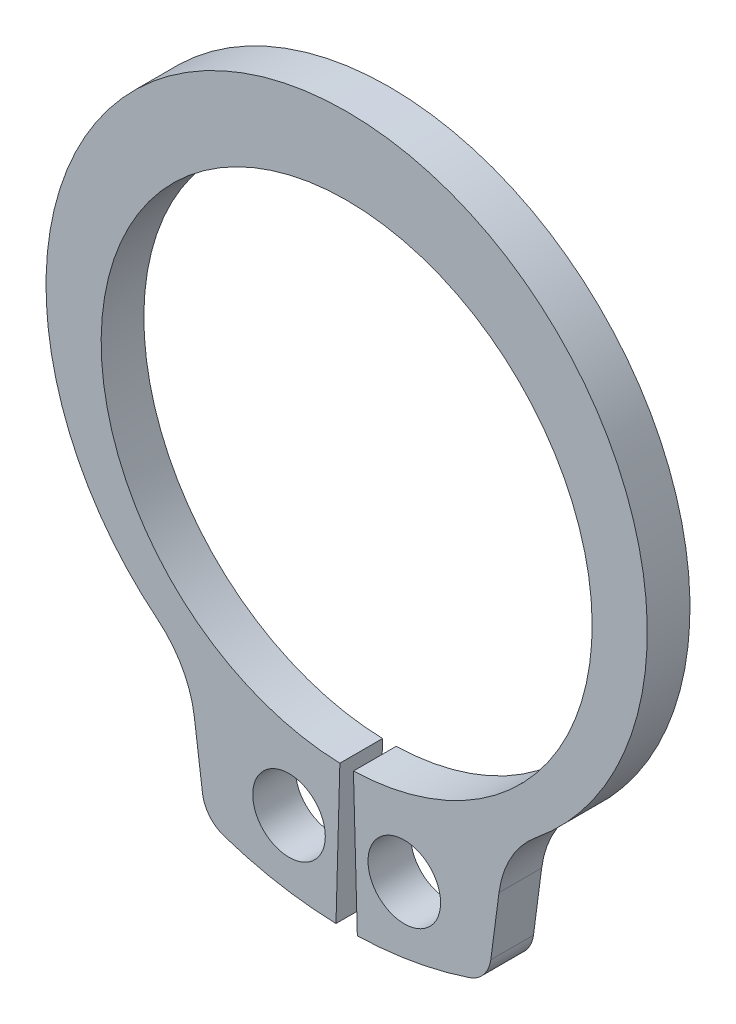
ISO-10303-21;
HEADER;
FILE_DESCRIPTION(('STEP AP214'),'2;1');
FILE_NAME('part.step','',(''),(''),'','','');
FILE_SCHEMA(('AUTOMOTIVE_DESIGN { 1 0 10303 214 1 1 1 1 }'));
ENDSEC;
DATA;
#1=APPLICATION_CONTEXT('core data for automotive mechanical design processes');
#2=APPLICATION_PROTOCOL_DEFINITION('international standard','automotive_design',2000,#1);
#3=PRODUCT_CONTEXT('',#1,'mechanical');
#4=PRODUCT('Part','Part','',(#3));
#5=PRODUCT_RELATED_PRODUCT_CATEGORY('part','',(#4));
#6=PRODUCT_DEFINITION_FORMATION('','',#4);
#7=PRODUCT_DEFINITION_CONTEXT('part definition',#1,'design');
#8=PRODUCT_DEFINITION('design','',#6,#7);
#9=PRODUCT_DEFINITION_SHAPE('','',#8);
#10=(LENGTH_UNIT() NAMED_UNIT(*) SI_UNIT(.MILLI.,.METRE.));
#11=(NAMED_UNIT(*) PLANE_ANGLE_UNIT() SI_UNIT($,.RADIAN.));
#12=(NAMED_UNIT(*) SI_UNIT($,.STERADIAN.) SOLID_ANGLE_UNIT());
#13=UNCERTAINTY_MEASURE_WITH_UNIT(LENGTH_MEASURE(1.E-05),#10,'distance_accuracy_value','');
#14=(GEOMETRIC_REPRESENTATION_CONTEXT(3) GLOBAL_UNCERTAINTY_ASSIGNED_CONTEXT((#13)) GLOBAL_UNIT_ASSIGNED_CONTEXT((#10,
#11,#12)) REPRESENTATION_CONTEXT('',''));
#15=CARTESIAN_POINT('',(0.,0.,0.));
#16=DIRECTION('',(0.,0.,1.));
#17=DIRECTION('',(1.,0.,0.));
#18=AXIS2_PLACEMENT_3D('',#15,#16,#17);
#19=CARTESIAN_POINT('',(0.,0.,-1.));
#20=DIRECTION('',(0.,0.,1.));
#21=DIRECTION('',(1.,0.,0.));
#22=AXIS2_PLACEMENT_3D('',#19,#20,#21);
#23=CYLINDRICAL_SURFACE('',#22,5.75);
#24=CARTESIAN_POINT('',(0.,0.,0.));
#25=DIRECTION('',(0.,0.,-1.));
#26=DIRECTION('',(1.,0.,0.));
#27=AXIS2_PLACEMENT_3D('',#24,#25,#26);
#28=CIRCLE('',#27,5.75);
#29=CARTESIAN_POINT('',(-0.158839779005525,-5.74780566169434,0.));
#30=VERTEX_POINT('',#29);
#31=CARTESIAN_POINT('',(0.158839779005525,-5.74780566169434,0.));
#32=VERTEX_POINT('',#31);
#33=EDGE_CURVE('E153',#30,#32,#28,.T.);
#34=ORIENTED_EDGE('',*,*,#33,.F.);
#35=DIRECTION('',(0.,0.,1.));
#36=VECTOR('',#35,1.);
#37=CARTESIAN_POINT('',(-0.158839779005525,-5.74780566169434,-1.));
#38=LINE('',#37,#36);
#39=CARTESIAN_POINT('',(-0.158839779005525,-5.74780566169434,-1.));
#40=VERTEX_POINT('',#39);
#41=EDGE_CURVE('E11',#40,#30,#38,.T.);
#42=ORIENTED_EDGE('',*,*,#41,.F.);
#43=CARTESIAN_POINT('',(0.,0.,-1.));
#44=DIRECTION('',(0.,0.,-1.));
#45=DIRECTION('',(1.,0.,0.));
#46=AXIS2_PLACEMENT_3D('',#43,#44,#45);
#47=CIRCLE('',#46,5.75);
#48=CARTESIAN_POINT('',(0.158839779005525,-5.74780566169434,-1.));
#49=VERTEX_POINT('',#48);
#50=EDGE_CURVE('E186',#40,#49,#47,.T.);
#51=ORIENTED_EDGE('',*,*,#50,.T.);
#52=DIRECTION('',(0.,0.,1.));
#53=VECTOR('',#52,1.);
#54=CARTESIAN_POINT('',(0.158839779005525,-5.74780566169434,-1.));
#55=LINE('',#54,#53);
#56=EDGE_CURVE('E35',#49,#32,#55,.T.);
#57=ORIENTED_EDGE('',*,*,#56,.T.);
#58=EDGE_LOOP('',(#34,#42,#51,#57));
#59=FACE_BOUND('',#58,.T.);
#60=ADVANCED_FACE('F32',(#59),#23,.F.);
#61=CARTESIAN_POINT('',(-0.158839779005525,-5.74780566169434,-1.));
#62=DIRECTION('',(0.999618375946841,-0.0276243093922652,0.));
#63=DIRECTION('',(0.0276243093922652,0.999618375946841,0.));
#64=AXIS2_PLACEMENT_3D('',#61,#62,#63);
#65=PLANE('',#64);
#66=DIRECTION('',(0.0276243093922652,0.999618375946841,0.));
#67=VECTOR('',#66,1.);
#68=CARTESIAN_POINT('',(-0.158839779005525,-5.74780566169434,0.));
#69=LINE('',#68,#67);
#70=CARTESIAN_POINT('',(-0.25,-9.04654630231891,0.));
#71=VERTEX_POINT('',#70);
#72=EDGE_CURVE('E184',#71,#30,#69,.T.);
#73=ORIENTED_EDGE('',*,*,#72,.F.);
#74=DIRECTION('',(0.,0.,1.));
#75=VECTOR('',#74,1.);
#76=CARTESIAN_POINT('',(-0.25,-9.04654630231891,-1.));
#77=LINE('',#76,#75);
#78=CARTESIAN_POINT('',(-0.25,-9.04654630231891,-1.));
#79=VERTEX_POINT('',#78);
#80=EDGE_CURVE('E41',#79,#71,#77,.T.);
#81=ORIENTED_EDGE('',*,*,#80,.F.);
#82=DIRECTION('',(0.0276243093922652,0.999618375946841,0.));
#83=VECTOR('',#82,1.);
#84=CARTESIAN_POINT('',(-0.158839779005525,-5.74780566169434,-1.));
#85=LINE('',#84,#83);
#86=EDGE_CURVE('E143',#79,#40,#85,.T.);
#87=ORIENTED_EDGE('',*,*,#86,.T.);
#88=ORIENTED_EDGE('',*,*,#41,.T.);
#89=EDGE_LOOP('',(#73,#81,#87,#88));
#90=FACE_BOUND('',#89,.T.);
#91=ADVANCED_FACE('F206',(#90),#65,.T.);
#92=CARTESIAN_POINT('',(0.,0.,-1.));
#93=DIRECTION('',(0.,0.,1.));
#94=DIRECTION('',(1.,0.,0.));
#95=AXIS2_PLACEMENT_3D('',#92,#93,#94);
#96=CYLINDRICAL_SURFACE('',#95,9.05);
#97=CARTESIAN_POINT('',(0.,0.,0.));
#98=DIRECTION('',(0.,0.,1.));
#99=DIRECTION('',(1.,0.,0.));
#100=AXIS2_PLACEMENT_3D('',#97,#98,#99);
#101=CIRCLE('',#100,9.05);
#102=CARTESIAN_POINT('',(-2.87007776682859,-8.5828406493629,0.));
#103=VERTEX_POINT('',#102);
#104=EDGE_CURVE('E130',#103,#71,#101,.T.);
#105=ORIENTED_EDGE('',*,*,#104,.F.);
#106=DIRECTION('',(0.,0.,1.));
#107=VECTOR('',#106,1.);
#108=CARTESIAN_POINT('',(-2.87007776682859,-8.5828406493629,-1.));
#109=LINE('',#108,#107);
#110=CARTESIAN_POINT('',(-2.87007776682859,-8.5828406493629,-1.));
#111=VERTEX_POINT('',#110);
#112=EDGE_CURVE('E125',#111,#103,#109,.T.);
#113=ORIENTED_EDGE('',*,*,#112,.F.);
#114=CARTESIAN_POINT('',(0.,0.,-1.));
#115=DIRECTION('',(0.,0.,1.));
#116=DIRECTION('',(1.,0.,0.));
#117=AXIS2_PLACEMENT_3D('',#114,#115,#116);
#118=CIRCLE('',#117,9.05);
#119=EDGE_CURVE('E128',#111,#79,#118,.T.);
#120=ORIENTED_EDGE('',*,*,#119,.T.);
#121=ORIENTED_EDGE('',*,*,#80,.T.);
#122=EDGE_LOOP('',(#105,#113,#120,#121));
#123=FACE_BOUND('',#122,.T.);
#124=ADVANCED_FACE('F127',(#123),#96,.T.);
#125=CARTESIAN_POINT('',(-2.63222601819639,-7.87155551267537,-1.));
#126=DIRECTION('',(0.,0.,1.));
#127=DIRECTION('',(1.,0.,0.));
#128=AXIS2_PLACEMENT_3D('',#125,#126,#127);
#129=CYLINDRICAL_SURFACE('',#128,0.749999999999999);
#130=CARTESIAN_POINT('',(-2.63222601819639,-7.87155551267537,0.));
#131=DIRECTION('',(0.,0.,1.));
#132=DIRECTION('',(1.,0.,0.));
#133=AXIS2_PLACEMENT_3D('',#130,#131,#132);
#134=CIRCLE('',#133,0.749999999999999);
#135=CARTESIAN_POINT('',(-3.37580966422674,-7.96945015684041,0.));
#136=VERTEX_POINT('',#135);
#137=EDGE_CURVE('E181',#136,#103,#134,.T.);
#138=ORIENTED_EDGE('',*,*,#137,.F.);
#139=DIRECTION('',(0.,0.,1.));
#140=VECTOR('',#139,1.);
#141=CARTESIAN_POINT('',(-3.37580966422674,-7.96945015684041,-1.));
#142=LINE('',#141,#140);
#143=CARTESIAN_POINT('',(-3.37580966422674,-7.96945015684041,-1.));
#144=VERTEX_POINT('',#143);
#145=EDGE_CURVE('E135',#144,#136,#142,.T.);
#146=ORIENTED_EDGE('',*,*,#145,.F.);
#147=CARTESIAN_POINT('',(-2.63222601819639,-7.87155551267537,-1.));
#148=DIRECTION('',(0.,0.,1.));
#149=DIRECTION('',(1.,0.,0.));
#150=AXIS2_PLACEMENT_3D('',#147,#148,#149);
#151=CIRCLE('',#150,0.749999999999999);
#152=EDGE_CURVE('E141',#144,#111,#151,.T.);
#153=ORIENTED_EDGE('',*,*,#152,.T.);
#154=ORIENTED_EDGE('',*,*,#112,.T.);
#155=EDGE_LOOP('',(#138,#146,#153,#154));
#156=FACE_BOUND('',#155,.T.);
#157=ADVANCED_FACE('F145',(#156),#129,.T.);
#158=CARTESIAN_POINT('',(-3.56793709135462,-6.51009746206657,-1.));
#159=DIRECTION('',(-0.99144486137381,-0.130526192220053,0.));
#160=DIRECTION('',(0.130526192220053,-0.99144486137381,0.));
#161=AXIS2_PLACEMENT_3D('',#158,#159,#160);
#162=PLANE('',#161);
#163=DIRECTION('',(0.130526192220053,-0.99144486137381,0.));
#164=VECTOR('',#163,1.);
#165=CARTESIAN_POINT('',(-3.56793709135462,-6.51009746206657,0.));
#166=LINE('',#165,#164);
#167=CARTESIAN_POINT('',(-3.56793709135462,-6.51009746206657,0.));
#168=VERTEX_POINT('',#167);
#169=EDGE_CURVE('E178',#168,#136,#166,.T.);
#170=ORIENTED_EDGE('',*,*,#169,.F.);
#171=DIRECTION('',(0.,0.,1.));
#172=VECTOR('',#171,1.);
#173=CARTESIAN_POINT('',(-3.56793709135462,-6.51009746206657,-1.));
#174=LINE('',#173,#172);
#175=CARTESIAN_POINT('',(-3.56793709135462,-6.51009746206657,-1.));
#176=VERTEX_POINT('',#175);
#177=EDGE_CURVE('E190',#176,#168,#174,.T.);
#178=ORIENTED_EDGE('',*,*,#177,.F.);
#179=DIRECTION('',(0.130526192220053,-0.99144486137381,0.));
#180=VECTOR('',#179,1.);
#181=CARTESIAN_POINT('',(-3.56793709135462,-6.51009746206657,-1.));
#182=LINE('',#181,#180);
#183=EDGE_CURVE('E146',#176,#144,#182,.T.);
#184=ORIENTED_EDGE('',*,*,#183,.T.);
#185=ORIENTED_EDGE('',*,*,#145,.T.);
#186=EDGE_LOOP('',(#170,#178,#184,#185));
#187=FACE_BOUND('',#186,.T.);
#188=ADVANCED_FACE('F219',(#187),#162,.T.);
#189=CARTESIAN_POINT('',(-5.94540544054401,-6.82309710817233,-1.));
#190=DIRECTION('',(0.,0.,1.));
#191=DIRECTION('',(1.,0.,0.));
#192=AXIS2_PLACEMENT_3D('',#189,#190,#191);
#193=CYLINDRICAL_SURFACE('',#192,2.39798342985511);
#194=CARTESIAN_POINT('',(-5.94540544054401,-6.82309710817233,0.));
#195=DIRECTION('',(0.,0.,-1.));
#196=DIRECTION('',(1.,0.,0.));
#197=AXIS2_PLACEMENT_3D('',#194,#195,#196);
#198=CIRCLE('',#197,2.39798342985511);
#199=CARTESIAN_POINT('',(-4.43503151096838,-4.96054640477713,0.));
#200=VERTEX_POINT('',#199);
#201=EDGE_CURVE('E175',#200,#168,#198,.T.);
#202=ORIENTED_EDGE('',*,*,#201,.F.);
#203=DIRECTION('',(0.,0.,1.));
#204=VECTOR('',#203,1.);
#205=CARTESIAN_POINT('',(-4.43503151096838,-4.96054640477713,-1.));
#206=LINE('',#205,#204);
#207=CARTESIAN_POINT('',(-4.43503151096838,-4.96054640477713,-1.));
#208=VERTEX_POINT('',#207);
#209=EDGE_CURVE('E192',#208,#200,#206,.T.);
#210=ORIENTED_EDGE('',*,*,#209,.F.);
#211=CARTESIAN_POINT('',(-5.94540544054401,-6.82309710817233,-1.));
#212=DIRECTION('',(0.,0.,-1.));
#213=DIRECTION('',(1.,0.,0.));
#214=AXIS2_PLACEMENT_3D('',#211,#212,#213);
#215=CIRCLE('',#214,2.39798342985511);
#216=EDGE_CURVE('E148',#208,#176,#215,.T.);
#217=ORIENTED_EDGE('',*,*,#216,.T.);
#218=ORIENTED_EDGE('',*,*,#177,.T.);
#219=EDGE_LOOP('',(#202,#210,#217,#218));
#220=FACE_BOUND('',#219,.T.);
#221=ADVANCED_FACE('F222',(#220),#193,.F.);
#222=CARTESIAN_POINT('',(0.,0.508609874062364,-1.));
#223=DIRECTION('',(0.,0.,1.));
#224=DIRECTION('',(1.,0.,0.));
#225=AXIS2_PLACEMENT_3D('',#222,#223,#224);
#226=CYLINDRICAL_SURFACE('',#225,7.04139012593763);
#227=CARTESIAN_POINT('',(0.,0.508609874062364,0.));
#228=DIRECTION('',(0.,0.,1.));
#229=DIRECTION('',(1.,0.,0.));
#230=AXIS2_PLACEMENT_3D('',#227,#228,#229);
#231=CIRCLE('',#230,7.04139012593763);
#232=CARTESIAN_POINT('',(4.43503151096838,-4.96054640477713,0.));
#233=VERTEX_POINT('',#232);
#234=EDGE_CURVE('E172',#233,#200,#231,.T.);
#235=ORIENTED_EDGE('',*,*,#234,.F.);
#236=DIRECTION('',(0.,0.,1.));
#237=VECTOR('',#236,1.);
#238=CARTESIAN_POINT('',(4.43503151096838,-4.96054640477713,-1.));
#239=LINE('',#238,#237);
#240=CARTESIAN_POINT('',(4.43503151096838,-4.96054640477713,-1.));
#241=VERTEX_POINT('',#240);
#242=EDGE_CURVE('E194',#241,#233,#239,.T.);
#243=ORIENTED_EDGE('',*,*,#242,.F.);
#244=CARTESIAN_POINT('',(0.,0.508609874062364,-1.));
#245=DIRECTION('',(0.,0.,1.));
#246=DIRECTION('',(1.,0.,0.));
#247=AXIS2_PLACEMENT_3D('',#244,#245,#246);
#248=CIRCLE('',#247,7.04139012593763);
#249=EDGE_CURVE('E296',#241,#208,#248,.T.);
#250=ORIENTED_EDGE('',*,*,#249,.T.);
#251=ORIENTED_EDGE('',*,*,#209,.T.);
#252=EDGE_LOOP('',(#235,#243,#250,#251));
#253=FACE_BOUND('',#252,.T.);
#254=ADVANCED_FACE('F226',(#253),#226,.T.);
#255=CARTESIAN_POINT('',(5.94540544054401,-6.82309710817233,-1.));
#256=DIRECTION('',(0.,0.,1.));
#257=DIRECTION('',(1.,0.,0.));
#258=AXIS2_PLACEMENT_3D('',#255,#256,#257);
#259=CYLINDRICAL_SURFACE('',#258,2.39798342985511);
#260=CARTESIAN_POINT('',(5.94540544054401,-6.82309710817233,0.));
#261=DIRECTION('',(0.,0.,-1.));
#262=DIRECTION('',(1.,0.,0.));
#263=AXIS2_PLACEMENT_3D('',#260,#261,#262);
#264=CIRCLE('',#263,2.39798342985511);
#265=CARTESIAN_POINT('',(3.56793709135462,-6.51009746206657,0.));
#266=VERTEX_POINT('',#265);
#267=EDGE_CURVE('E169',#266,#233,#264,.T.);
#268=ORIENTED_EDGE('',*,*,#267,.F.);
#269=DIRECTION('',(0.,0.,1.));
#270=VECTOR('',#269,1.);
#271=CARTESIAN_POINT('',(3.56793709135462,-6.51009746206657,-1.));
#272=LINE('',#271,#270);
#273=CARTESIAN_POINT('',(3.56793709135462,-6.51009746206657,-1.));
#274=VERTEX_POINT('',#273);
#275=EDGE_CURVE('E196',#274,#266,#272,.T.);
#276=ORIENTED_EDGE('',*,*,#275,.F.);
#277=CARTESIAN_POINT('',(5.94540544054401,-6.82309710817233,-1.));
#278=DIRECTION('',(0.,0.,-1.));
#279=DIRECTION('',(1.,0.,0.));
#280=AXIS2_PLACEMENT_3D('',#277,#278,#279);
#281=CIRCLE('',#280,2.39798342985511);
#282=EDGE_CURVE('E293',#274,#241,#281,.T.);
#283=ORIENTED_EDGE('',*,*,#282,.T.);
#284=ORIENTED_EDGE('',*,*,#242,.T.);
#285=EDGE_LOOP('',(#268,#276,#283,#284));
#286=FACE_BOUND('',#285,.T.);
#287=ADVANCED_FACE('F230',(#286),#259,.F.);
#288=CARTESIAN_POINT('',(3.56793709135462,-6.51009746206657,-1.));
#289=DIRECTION('',(0.99144486137381,-0.130526192220053,0.));
#290=DIRECTION('',(0.130526192220053,0.99144486137381,0.));
#291=AXIS2_PLACEMENT_3D('',#288,#289,#290);
#292=PLANE('',#291);
#293=DIRECTION('',(0.130526192220053,0.99144486137381,0.));
#294=VECTOR('',#293,1.);
#295=CARTESIAN_POINT('',(3.56793709135462,-6.51009746206657,0.));
#296=LINE('',#295,#294);
#297=CARTESIAN_POINT('',(3.37580966422674,-7.96945015684041,0.));
#298=VERTEX_POINT('',#297);
#299=EDGE_CURVE('E166',#298,#266,#296,.T.);
#300=ORIENTED_EDGE('',*,*,#299,.F.);
#301=DIRECTION('',(0.,0.,1.));
#302=VECTOR('',#301,1.);
#303=CARTESIAN_POINT('',(3.37580966422674,-7.96945015684041,-1.));
#304=LINE('',#303,#302);
#305=CARTESIAN_POINT('',(3.37580966422674,-7.96945015684041,-1.));
#306=VERTEX_POINT('',#305);
#307=EDGE_CURVE('E198',#306,#298,#304,.T.);
#308=ORIENTED_EDGE('',*,*,#307,.F.);
#309=DIRECTION('',(0.130526192220053,0.99144486137381,0.));
#310=VECTOR('',#309,1.);
#311=CARTESIAN_POINT('',(3.56793709135462,-6.51009746206657,-1.));
#312=LINE('',#311,#310);
#313=EDGE_CURVE('E290',#306,#274,#312,.T.);
#314=ORIENTED_EDGE('',*,*,#313,.T.);
#315=ORIENTED_EDGE('',*,*,#275,.T.);
#316=EDGE_LOOP('',(#300,#308,#314,#315));
#317=FACE_BOUND('',#316,.T.);
#318=ADVANCED_FACE('F234',(#317),#292,.T.);
#319=CARTESIAN_POINT('',(2.63222601819639,-7.87155551267537,-1.));
#320=DIRECTION('',(0.,0.,1.));
#321=DIRECTION('',(1.,0.,0.));
#322=AXIS2_PLACEMENT_3D('',#319,#320,#321);
#323=CYLINDRICAL_SURFACE('',#322,0.749999999999999);
#324=CARTESIAN_POINT('',(2.63222601819639,-7.87155551267537,0.));
#325=DIRECTION('',(0.,0.,1.));
#326=DIRECTION('',(-1.,0.,0.));
#327=AXIS2_PLACEMENT_3D('',#324,#325,#326);
#328=CIRCLE('',#327,0.749999999999999);
#329=CARTESIAN_POINT('',(2.87007776682859,-8.5828406493629,0.));
#330=VERTEX_POINT('',#329);
#331=EDGE_CURVE('E163',#330,#298,#328,.T.);
#332=ORIENTED_EDGE('',*,*,#331,.F.);
#333=DIRECTION('',(0.,0.,1.));
#334=VECTOR('',#333,1.);
#335=CARTESIAN_POINT('',(2.87007776682859,-8.5828406493629,-1.));
#336=LINE('',#335,#334);
#337=CARTESIAN_POINT('',(2.87007776682859,-8.5828406493629,-1.));
#338=VERTEX_POINT('',#337);
#339=EDGE_CURVE('E200',#338,#330,#336,.T.);
#340=ORIENTED_EDGE('',*,*,#339,.F.);
#341=CARTESIAN_POINT('',(2.63222601819639,-7.87155551267537,-1.));
#342=DIRECTION('',(0.,0.,1.));
#343=DIRECTION('',(-1.,0.,0.));
#344=AXIS2_PLACEMENT_3D('',#341,#342,#343);
#345=CIRCLE('',#344,0.749999999999999);
#346=EDGE_CURVE('E287',#338,#306,#345,.T.);
#347=ORIENTED_EDGE('',*,*,#346,.T.);
#348=ORIENTED_EDGE('',*,*,#307,.T.);
#349=EDGE_LOOP('',(#332,#340,#347,#348));
#350=FACE_BOUND('',#349,.T.);
#351=ADVANCED_FACE('F238',(#350),#323,.T.);
#352=CARTESIAN_POINT('',(0.,0.,-1.));
#353=DIRECTION('',(0.,0.,1.));
#354=DIRECTION('',(1.,0.,0.));
#355=AXIS2_PLACEMENT_3D('',#352,#353,#354);
#356=CYLINDRICAL_SURFACE('',#355,9.05);
#357=CARTESIAN_POINT('',(0.,0.,0.));
#358=DIRECTION('',(0.,0.,1.));
#359=DIRECTION('',(1.,0.,0.));
#360=AXIS2_PLACEMENT_3D('',#357,#358,#359);
#361=CIRCLE('',#360,9.05);
#362=CARTESIAN_POINT('',(0.249999999999998,-9.04654630231891,0.));
#363=VERTEX_POINT('',#362);
#364=EDGE_CURVE('E160',#363,#330,#361,.T.);
#365=ORIENTED_EDGE('',*,*,#364,.F.);
#366=DIRECTION('',(0.,0.,1.));
#367=VECTOR('',#366,1.);
#368=CARTESIAN_POINT('',(0.249999999999998,-9.04654630231891,-1.));
#369=LINE('',#368,#367);
#370=CARTESIAN_POINT('',(0.249999999999998,-9.04654630231891,-1.));
#371=VERTEX_POINT('',#370);
#372=EDGE_CURVE('E201',#371,#363,#369,.T.);
#373=ORIENTED_EDGE('',*,*,#372,.F.);
#374=CARTESIAN_POINT('',(0.,0.,-1.));
#375=DIRECTION('',(0.,0.,1.));
#376=DIRECTION('',(1.,0.,0.));
#377=AXIS2_PLACEMENT_3D('',#374,#375,#376);
#378=CIRCLE('',#377,9.05);
#379=EDGE_CURVE('E284',#371,#338,#378,.T.);
#380=ORIENTED_EDGE('',*,*,#379,.T.);
#381=ORIENTED_EDGE('',*,*,#339,.T.);
#382=EDGE_LOOP('',(#365,#373,#380,#381));
#383=FACE_BOUND('',#382,.T.);
#384=ADVANCED_FACE('F242',(#383),#356,.T.);
#385=CARTESIAN_POINT('',(0.158839779005525,-5.74780566169434,-1.));
#386=DIRECTION('',(-0.999618375946841,-0.0276243093922652,0.));
#387=DIRECTION('',(0.0276243093922652,-0.999618375946841,0.));
#388=AXIS2_PLACEMENT_3D('',#385,#386,#387);
#389=PLANE('',#388);
#390=DIRECTION('',(0.0276243093922652,-0.999618375946841,0.));
#391=VECTOR('',#390,1.);
#392=CARTESIAN_POINT('',(0.158839779005525,-5.74780566169434,0.));
#393=LINE('',#392,#391);
#394=EDGE_CURVE('E156',#32,#363,#393,.T.);
#395=ORIENTED_EDGE('',*,*,#394,.F.);
#396=ORIENTED_EDGE('',*,*,#56,.F.);
#397=DIRECTION('',(0.0276243093922652,-0.999618375946841,0.));
#398=VECTOR('',#397,1.);
#399=CARTESIAN_POINT('',(0.158839779005525,-5.74780566169434,-1.));
#400=LINE('',#399,#398);
#401=EDGE_CURVE('E282',#49,#371,#400,.T.);
#402=ORIENTED_EDGE('',*,*,#401,.T.);
#403=ORIENTED_EDGE('',*,*,#372,.T.);
#404=EDGE_LOOP('',(#395,#396,#402,#403));
#405=FACE_BOUND('',#404,.T.);
#406=ADVANCED_FACE('F203',(#405),#389,.T.);
#407=CARTESIAN_POINT('',(0.,0.,-1.));
#408=DIRECTION('',(0.,0.,1.));
#409=DIRECTION('',(1.,0.,0.));
#410=AXIS2_PLACEMENT_3D('',#407,#408,#409);
#411=PLANE('',#410);
#412=CARTESIAN_POINT('',(-1.35,-7.4029132778927,-1.));
#413=DIRECTION('',(0.,0.,1.));
#414=DIRECTION('',(1.,0.,0.));
#415=AXIS2_PLACEMENT_3D('',#412,#413,#414);
#416=CIRCLE('',#415,0.85);
#417=CARTESIAN_POINT('',(-0.5,-7.4029132778927,-1.));
#418=VERTEX_POINT('',#417);
#419=EDGE_CURVE('E269',#418,#418,#416,.T.);
#420=ORIENTED_EDGE('',*,*,#419,.T.);
#421=EDGE_LOOP('',(#420));
#422=FACE_BOUND('',#421,.T.);
#423=CARTESIAN_POINT('',(1.35,-7.4029132778927,-1.));
#424=DIRECTION('',(0.,0.,1.));
#425=DIRECTION('',(1.,0.,0.));
#426=AXIS2_PLACEMENT_3D('',#423,#424,#425);
#427=CIRCLE('',#426,0.85);
#428=CARTESIAN_POINT('',(2.2,-7.4029132778927,-1.));
#429=VERTEX_POINT('',#428);
#430=EDGE_CURVE('E157',#429,#429,#427,.T.);
#431=ORIENTED_EDGE('',*,*,#430,.T.);
#432=EDGE_LOOP('',(#431));
#433=FACE_BOUND('',#432,.T.);
#434=ORIENTED_EDGE('',*,*,#50,.F.);
#435=ORIENTED_EDGE('',*,*,#86,.F.);
#436=ORIENTED_EDGE('',*,*,#119,.F.);
#437=ORIENTED_EDGE('',*,*,#152,.F.);
#438=ORIENTED_EDGE('',*,*,#183,.F.);
#439=ORIENTED_EDGE('',*,*,#216,.F.);
#440=ORIENTED_EDGE('',*,*,#249,.F.);
#441=ORIENTED_EDGE('',*,*,#282,.F.);
#442=ORIENTED_EDGE('',*,*,#313,.F.);
#443=ORIENTED_EDGE('',*,*,#346,.F.);
#444=ORIENTED_EDGE('',*,*,#379,.F.);
#445=ORIENTED_EDGE('',*,*,#401,.F.);
#446=EDGE_LOOP('',(#434,#435,#436,#437,#438,#439,#440,#441,#442,#443,#444,#445));
#447=FACE_BOUND('',#446,.T.);
#448=ADVANCED_FACE('F139',(#422,#433,#447),#411,.F.);
#449=CARTESIAN_POINT('',(0.,0.,0.));
#450=DIRECTION('',(0.,0.,1.));
#451=DIRECTION('',(1.,0.,0.));
#452=AXIS2_PLACEMENT_3D('',#449,#450,#451);
#453=PLANE('',#452);
#454=CARTESIAN_POINT('',(-1.35,-7.4029132778927,0.));
#455=DIRECTION('',(0.,0.,1.));
#456=DIRECTION('',(1.,0.,0.));
#457=AXIS2_PLACEMENT_3D('',#454,#455,#456);
#458=CIRCLE('',#457,0.85);
#459=CARTESIAN_POINT('',(-0.5,-7.4029132778927,0.));
#460=VERTEX_POINT('',#459);
#461=EDGE_CURVE('E272',#460,#460,#458,.T.);
#462=ORIENTED_EDGE('',*,*,#461,.F.);
#463=EDGE_LOOP('',(#462));
#464=FACE_BOUND('',#463,.T.);
#465=CARTESIAN_POINT('',(1.35,-7.4029132778927,0.));
#466=DIRECTION('',(0.,0.,1.));
#467=DIRECTION('',(1.,0.,0.));
#468=AXIS2_PLACEMENT_3D('',#465,#466,#467);
#469=CIRCLE('',#468,0.85);
#470=CARTESIAN_POINT('',(2.2,-7.4029132778927,0.));
#471=VERTEX_POINT('',#470);
#472=EDGE_CURVE('E274',#471,#471,#469,.T.);
#473=ORIENTED_EDGE('',*,*,#472,.F.);
#474=EDGE_LOOP('',(#473));
#475=FACE_BOUND('',#474,.T.);
#476=ORIENTED_EDGE('',*,*,#33,.T.);
#477=ORIENTED_EDGE('',*,*,#394,.T.);
#478=ORIENTED_EDGE('',*,*,#364,.T.);
#479=ORIENTED_EDGE('',*,*,#331,.T.);
#480=ORIENTED_EDGE('',*,*,#299,.T.);
#481=ORIENTED_EDGE('',*,*,#267,.T.);
#482=ORIENTED_EDGE('',*,*,#234,.T.);
#483=ORIENTED_EDGE('',*,*,#201,.T.);
#484=ORIENTED_EDGE('',*,*,#169,.T.);
#485=ORIENTED_EDGE('',*,*,#137,.T.);
#486=ORIENTED_EDGE('',*,*,#104,.T.);
#487=ORIENTED_EDGE('',*,*,#72,.T.);
#488=EDGE_LOOP('',(#476,#477,#478,#479,#480,#481,#482,#483,#484,#485,#486,#487));
#489=FACE_BOUND('',#488,.T.);
#490=ADVANCED_FACE('F205',(#464,#475,#489),#453,.T.);
#491=CARTESIAN_POINT('',(1.35,-7.4029132778927,-1.));
#492=DIRECTION('',(0.,0.,1.));
#493=DIRECTION('',(1.,0.,0.));
#494=AXIS2_PLACEMENT_3D('',#491,#492,#493);
#495=CYLINDRICAL_SURFACE('',#494,0.85);
#496=ORIENTED_EDGE('',*,*,#430,.F.);
#497=EDGE_LOOP('',(#496));
#498=FACE_BOUND('',#497,.T.);
#499=ORIENTED_EDGE('',*,*,#472,.T.);
#500=EDGE_LOOP('',(#499));
#501=FACE_BOUND('',#500,.T.);
#502=ADVANCED_FACE('F254',(#498,#501),#495,.F.);
#503=CARTESIAN_POINT('',(-1.35,-7.4029132778927,-1.));
#504=DIRECTION('',(0.,0.,1.));
#505=DIRECTION('',(1.,0.,0.));
#506=AXIS2_PLACEMENT_3D('',#503,#504,#505);
#507=CYLINDRICAL_SURFACE('',#506,0.85);
#508=ORIENTED_EDGE('',*,*,#419,.F.);
#509=EDGE_LOOP('',(#508));
#510=FACE_BOUND('',#509,.T.);
#511=ORIENTED_EDGE('',*,*,#461,.T.);
#512=EDGE_LOOP('',(#511));
#513=FACE_BOUND('',#512,.T.);
#514=ADVANCED_FACE('F261',(#510,#513),#507,.F.);
#515=CLOSED_SHELL('',(#60,#91,#124,#157,#188,#221,#254,#287,#318,#351,#384,#406,#448,#490,#502,#514));
#516=MANIFOLD_SOLID_BREP('B2',#515);
#517=ADVANCED_BREP_SHAPE_REPRESENTATION('',(#18,#516),#14);
#518=SHAPE_DEFINITION_REPRESENTATION(#9,#517);
ENDSEC;
END-ISO-10303-21;
